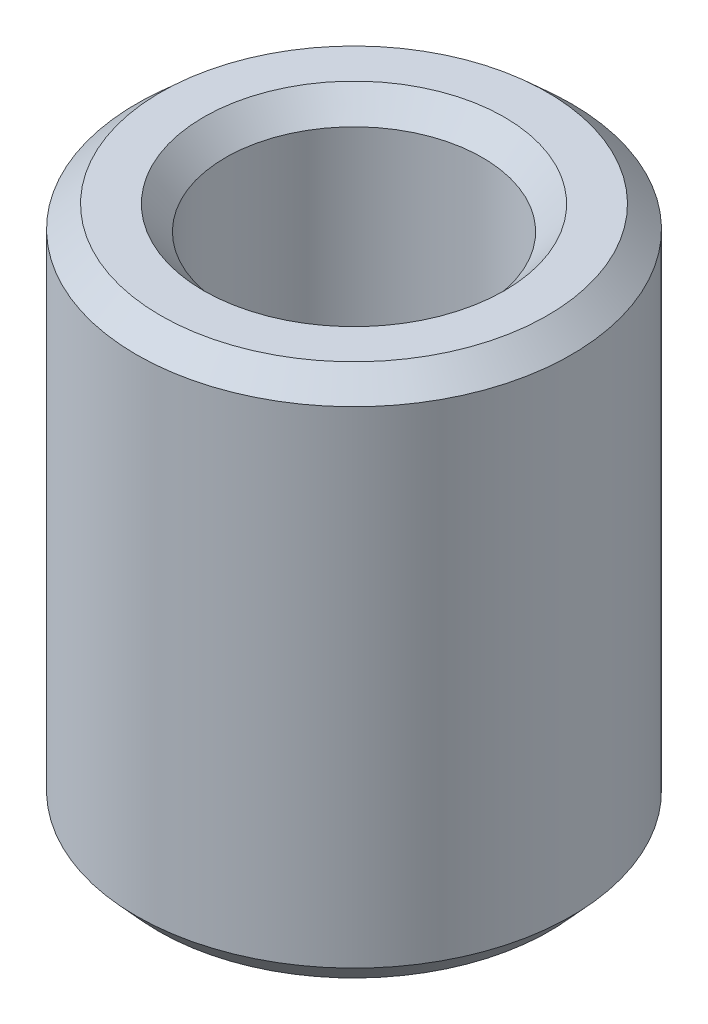
ISO-10303-21;
HEADER;
FILE_DESCRIPTION(('STEP AP214'),'2;1');
FILE_NAME('part.step','',(''),(''),'','','');
FILE_SCHEMA(('AUTOMOTIVE_DESIGN { 1 0 10303 214 1 1 1 1 }'));
ENDSEC;
DATA;
#1=APPLICATION_CONTEXT('core data for automotive mechanical design processes');
#2=APPLICATION_PROTOCOL_DEFINITION('international standard','automotive_design',2000,#1);
#3=PRODUCT_CONTEXT('',#1,'mechanical');
#4=PRODUCT('Part','Part','',(#3));
#5=PRODUCT_RELATED_PRODUCT_CATEGORY('part','',(#4));
#6=PRODUCT_DEFINITION_FORMATION('','',#4);
#7=PRODUCT_DEFINITION_CONTEXT('part definition',#1,'design');
#8=PRODUCT_DEFINITION('design','',#6,#7);
#9=PRODUCT_DEFINITION_SHAPE('','',#8);
#10=(LENGTH_UNIT() NAMED_UNIT(*) SI_UNIT(.MILLI.,.METRE.));
#11=(NAMED_UNIT(*) PLANE_ANGLE_UNIT() SI_UNIT($,.RADIAN.));
#12=(NAMED_UNIT(*) SI_UNIT($,.STERADIAN.) SOLID_ANGLE_UNIT());
#13=UNCERTAINTY_MEASURE_WITH_UNIT(LENGTH_MEASURE(1.E-05),#10,'distance_accuracy_value','');
#14=(GEOMETRIC_REPRESENTATION_CONTEXT(3) GLOBAL_UNCERTAINTY_ASSIGNED_CONTEXT((#13)) GLOBAL_UNIT_ASSIGNED_CONTEXT((#10,
#11,#12)) REPRESENTATION_CONTEXT('',''));
#15=CARTESIAN_POINT('',(0.,0.,0.));
#16=DIRECTION('',(0.,0.,1.));
#17=DIRECTION('',(1.,0.,0.));
#18=AXIS2_PLACEMENT_3D('',#15,#16,#17);
#19=CARTESIAN_POINT('',(0.,91.7810592375612,0.));
#20=DIRECTION('',(0.,-1.,0.));
#21=DIRECTION('',(0.,0.,-1.));
#22=AXIS2_PLACEMENT_3D('',#19,#20,#21);
#23=CYLINDRICAL_SURFACE('',#22,37.5);
#24=CARTESIAN_POINT('',(0.,4.14574089234723,0.));
#25=DIRECTION('',(0.,1.,0.));
#26=DIRECTION('',(0.,0.,1.));
#27=AXIS2_PLACEMENT_3D('',#24,#25,#26);
#28=CIRCLE('',#27,37.5);
#29=CARTESIAN_POINT('',(0.,4.14574089234723,37.5));
#30=VERTEX_POINT('',#29);
#31=EDGE_CURVE('E10',#30,#30,#28,.T.);
#32=ORIENTED_EDGE('',*,*,#31,.T.);
#33=EDGE_LOOP('',(#32));
#34=FACE_BOUND('',#33,.T.);
#35=CARTESIAN_POINT('',(0.,87.998015466207,0.));
#36=DIRECTION('',(0.,1.,0.));
#37=DIRECTION('',(0.,0.,1.));
#38=AXIS2_PLACEMENT_3D('',#35,#36,#37);
#39=CIRCLE('',#38,37.5);
#40=CARTESIAN_POINT('',(0.,87.998015466207,37.5));
#41=VERTEX_POINT('',#40);
#42=EDGE_CURVE('E50',#41,#41,#39,.F.);
#43=ORIENTED_EDGE('',*,*,#42,.T.);
#44=EDGE_LOOP('',(#43));
#45=FACE_BOUND('',#44,.T.);
#46=ADVANCED_FACE('F39',(#34,#45),#23,.T.);
#47=CARTESIAN_POINT('',(0.,91.7810592375612,0.));
#48=DIRECTION('',(0.,1.,0.));
#49=DIRECTION('',(0.,0.,1.));
#50=AXIS2_PLACEMENT_3D('',#47,#48,#49);
#51=PLANE('',#50);
#52=CARTESIAN_POINT('',(0.,91.7810592375612,0.));
#53=DIRECTION('',(0.,1.,0.));
#54=DIRECTION('',(0.,0.,1.));
#55=AXIS2_PLACEMENT_3D('',#52,#53,#54);
#56=CIRCLE('',#55,25.933526867072);
#57=CARTESIAN_POINT('',(0.,91.7810592375612,25.933526867072));
#58=VERTEX_POINT('',#57);
#59=EDGE_CURVE('E58',#58,#58,#56,.F.);
#60=ORIENTED_EDGE('',*,*,#59,.T.);
#61=EDGE_LOOP('',(#60));
#62=FACE_BOUND('',#61,.T.);
#63=CARTESIAN_POINT('',(0.,91.7810592375612,0.));
#64=DIRECTION('',(0.,1.,0.));
#65=DIRECTION('',(0.,0.,1.));
#66=AXIS2_PLACEMENT_3D('',#63,#64,#65);
#67=CIRCLE('',#66,33.3542591076528);
#68=CARTESIAN_POINT('',(0.,91.7810592375612,33.3542591076528));
#69=VERTEX_POINT('',#68);
#70=EDGE_CURVE('E61',#69,#69,#67,.T.);
#71=ORIENTED_EDGE('',*,*,#70,.T.);
#72=EDGE_LOOP('',(#71));
#73=FACE_BOUND('',#72,.T.);
#74=ADVANCED_FACE('F88',(#62,#73),#51,.T.);
#75=CARTESIAN_POINT('',(0.,0.,0.));
#76=DIRECTION('',(0.,1.,0.));
#77=DIRECTION('',(0.,0.,1.));
#78=AXIS2_PLACEMENT_3D('',#75,#76,#77);
#79=PLANE('',#78);
#80=CARTESIAN_POINT('',(0.,0.,0.));
#81=DIRECTION('',(0.,1.,0.));
#82=DIRECTION('',(0.,0.,1.));
#83=AXIS2_PLACEMENT_3D('',#80,#81,#82);
#84=CIRCLE('',#83,26.296223988065);
#85=CARTESIAN_POINT('',(0.,0.,26.296223988065));
#86=VERTEX_POINT('',#85);
#87=EDGE_CURVE('E51',#86,#86,#84,.T.);
#88=ORIENTED_EDGE('',*,*,#87,.T.);
#89=EDGE_LOOP('',(#88));
#90=FACE_BOUND('',#89,.T.);
#91=CARTESIAN_POINT('',(0.,0.,0.));
#92=DIRECTION('',(0.,1.,0.));
#93=DIRECTION('',(0.,0.,1.));
#94=AXIS2_PLACEMENT_3D('',#91,#92,#93);
#95=CIRCLE('',#94,33.7169562286458);
#96=CARTESIAN_POINT('',(0.,0.,33.7169562286458));
#97=VERTEX_POINT('',#96);
#98=EDGE_CURVE('E54',#97,#97,#95,.F.);
#99=ORIENTED_EDGE('',*,*,#98,.T.);
#100=EDGE_LOOP('',(#99));
#101=FACE_BOUND('',#100,.T.);
#102=ADVANCED_FACE('F83',(#90,#101),#79,.F.);
#103=CARTESIAN_POINT('',(0.,91.7810592375612,0.));
#104=DIRECTION('',(0.,-1.,0.));
#105=DIRECTION('',(0.,0.,-1.));
#106=AXIS2_PLACEMENT_3D('',#103,#104,#105);
#107=CYLINDRICAL_SURFACE('',#106,22.1504830957178);
#108=CARTESIAN_POINT('',(0.,87.635318345214,0.));
#109=DIRECTION('',(0.,1.,0.));
#110=DIRECTION('',(0.,0.,1.));
#111=AXIS2_PLACEMENT_3D('',#108,#109,#110);
#112=CIRCLE('',#111,22.1504830957178);
#113=CARTESIAN_POINT('',(0.,87.635318345214,22.1504830957178));
#114=VERTEX_POINT('',#113);
#115=EDGE_CURVE('E67',#114,#114,#112,.T.);
#116=ORIENTED_EDGE('',*,*,#115,.T.);
#117=EDGE_LOOP('',(#116));
#118=FACE_BOUND('',#117,.T.);
#119=CARTESIAN_POINT('',(0.,3.78304377135415,0.));
#120=DIRECTION('',(0.,1.,0.));
#121=DIRECTION('',(0.,0.,1.));
#122=AXIS2_PLACEMENT_3D('',#119,#120,#121);
#123=CIRCLE('',#122,22.1504830957178);
#124=CARTESIAN_POINT('',(0.,3.78304377135415,22.1504830957178));
#125=VERTEX_POINT('',#124);
#126=EDGE_CURVE('E69',#125,#125,#123,.F.);
#127=ORIENTED_EDGE('',*,*,#126,.T.);
#128=EDGE_LOOP('',(#127));
#129=FACE_BOUND('',#128,.T.);
#130=ADVANCED_FACE('F71',(#118,#129),#107,.F.);
#131=CARTESIAN_POINT('',(0.,87.635318345214,0.));
#132=DIRECTION('',(0.,1.,0.));
#133=DIRECTION('',(0.,0.,1.));
#134=AXIS2_PLACEMENT_3D('',#131,#132,#133);
#135=CONICAL_SURFACE('',#134,22.1504830957178,0.739685678225257);
#136=ORIENTED_EDGE('',*,*,#59,.F.);
#137=EDGE_LOOP('',(#136));
#138=FACE_BOUND('',#137,.T.);
#139=ORIENTED_EDGE('',*,*,#115,.F.);
#140=EDGE_LOOP('',(#139));
#141=FACE_BOUND('',#140,.T.);
#142=ADVANCED_FACE('F77',(#138,#141),#135,.F.);
#143=CARTESIAN_POINT('',(0.,0.,0.));
#144=DIRECTION('',(0.,-1.,0.));
#145=DIRECTION('',(0.,0.,-1.));
#146=AXIS2_PLACEMENT_3D('',#143,#144,#145);
#147=CONICAL_SURFACE('',#146,26.296223988065,0.831110648569642);
#148=ORIENTED_EDGE('',*,*,#126,.F.);
#149=EDGE_LOOP('',(#148));
#150=FACE_BOUND('',#149,.T.);
#151=ORIENTED_EDGE('',*,*,#87,.F.);
#152=EDGE_LOOP('',(#151));
#153=FACE_BOUND('',#152,.T.);
#154=ADVANCED_FACE('F73',(#150,#153),#147,.F.);
#155=CARTESIAN_POINT('',(0.,4.14574089234723,0.));
#156=DIRECTION('',(0.,1.,0.));
#157=DIRECTION('',(0.,0.,1.));
#158=AXIS2_PLACEMENT_3D('',#155,#156,#157);
#159=CONICAL_SURFACE('',#158,37.5,0.739685678225256);
#160=ORIENTED_EDGE('',*,*,#98,.F.);
#161=EDGE_LOOP('',(#160));
#162=FACE_BOUND('',#161,.T.);
#163=ORIENTED_EDGE('',*,*,#31,.F.);
#164=EDGE_LOOP('',(#163));
#165=FACE_BOUND('',#164,.T.);
#166=ADVANCED_FACE('F76',(#162,#165),#159,.T.);
#167=CARTESIAN_POINT('',(0.,91.7810592375612,0.));
#168=DIRECTION('',(0.,-1.,0.));
#169=DIRECTION('',(0.,0.,-1.));
#170=AXIS2_PLACEMENT_3D('',#167,#168,#169);
#171=CONICAL_SURFACE('',#170,33.3542591076528,0.83111064856964);
#172=ORIENTED_EDGE('',*,*,#42,.F.);
#173=EDGE_LOOP('',(#172));
#174=FACE_BOUND('',#173,.T.);
#175=ORIENTED_EDGE('',*,*,#70,.F.);
#176=EDGE_LOOP('',(#175));
#177=FACE_BOUND('',#176,.T.);
#178=ADVANCED_FACE('F45',(#174,#177),#171,.T.);
#179=CLOSED_SHELL('',(#46,#74,#102,#130,#142,#154,#166,#178));
#180=MANIFOLD_SOLID_BREP('B2',#179);
#181=ADVANCED_BREP_SHAPE_REPRESENTATION('',(#18,#180),#14);
#182=SHAPE_DEFINITION_REPRESENTATION(#9,#181);
ENDSEC;
END-ISO-10303-21;
